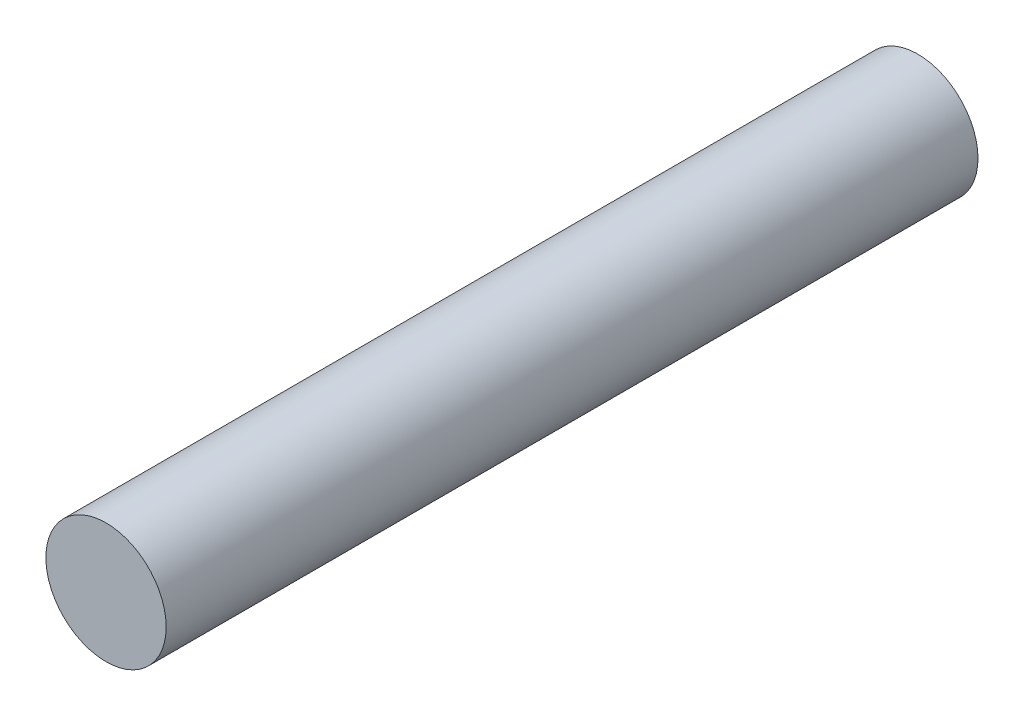
ISO-10303-21;
HEADER;
FILE_DESCRIPTION(('STEP AP214'),'2;1');
FILE_NAME('part.step','',(''),(''),'','','');
FILE_SCHEMA(('AUTOMOTIVE_DESIGN { 1 0 10303 214 1 1 1 1 }'));
ENDSEC;
DATA;
#1=APPLICATION_CONTEXT('core data for automotive mechanical design processes');
#2=APPLICATION_PROTOCOL_DEFINITION('international standard','automotive_design',2000,#1);
#3=PRODUCT_CONTEXT('',#1,'mechanical');
#4=PRODUCT('Part','Part','',(#3));
#5=PRODUCT_RELATED_PRODUCT_CATEGORY('part','',(#4));
#6=PRODUCT_DEFINITION_FORMATION('','',#4);
#7=PRODUCT_DEFINITION_CONTEXT('part definition',#1,'design');
#8=PRODUCT_DEFINITION('design','',#6,#7);
#9=PRODUCT_DEFINITION_SHAPE('','',#8);
#10=(LENGTH_UNIT() NAMED_UNIT(*) SI_UNIT(.MILLI.,.METRE.));
#11=(NAMED_UNIT(*) PLANE_ANGLE_UNIT() SI_UNIT($,.RADIAN.));
#12=(NAMED_UNIT(*) SI_UNIT($,.STERADIAN.) SOLID_ANGLE_UNIT());
#13=UNCERTAINTY_MEASURE_WITH_UNIT(LENGTH_MEASURE(1.E-05),#10,'distance_accuracy_value','');
#14=(GEOMETRIC_REPRESENTATION_CONTEXT(3) GLOBAL_UNCERTAINTY_ASSIGNED_CONTEXT((#13)) GLOBAL_UNIT_ASSIGNED_CONTEXT((#10,
#11,#12)) REPRESENTATION_CONTEXT('',''));
#15=CARTESIAN_POINT('',(0.,0.,0.));
#16=DIRECTION('',(0.,0.,1.));
#17=DIRECTION('',(1.,0.,0.));
#18=AXIS2_PLACEMENT_3D('',#15,#16,#17);
#19=CARTESIAN_POINT('',(0.,0.,42.8625));
#20=DIRECTION('',(0.,0.,-1.));
#21=DIRECTION('',(-1.,0.,0.));
#22=AXIS2_PLACEMENT_3D('',#19,#20,#21);
#23=CYLINDRICAL_SURFACE('',#22,3.175);
#24=CARTESIAN_POINT('',(0.,0.,42.8625));
#25=DIRECTION('',(0.,0.,1.));
#26=DIRECTION('',(1.,0.,0.));
#27=AXIS2_PLACEMENT_3D('',#24,#25,#26);
#28=CIRCLE('',#27,3.175);
#29=CARTESIAN_POINT('',(3.175,0.,42.8625));
#30=VERTEX_POINT('',#29);
#31=EDGE_CURVE('E10',#30,#30,#28,.T.);
#32=ORIENTED_EDGE('',*,*,#31,.F.);
#33=EDGE_LOOP('',(#32));
#34=FACE_BOUND('',#33,.T.);
#35=CARTESIAN_POINT('',(0.,0.,0.));
#36=DIRECTION('',(0.,0.,1.));
#37=DIRECTION('',(1.,0.,0.));
#38=AXIS2_PLACEMENT_3D('',#35,#36,#37);
#39=CIRCLE('',#38,3.175);
#40=CARTESIAN_POINT('',(3.175,0.,0.));
#41=VERTEX_POINT('',#40);
#42=EDGE_CURVE('E32',#41,#41,#39,.T.);
#43=ORIENTED_EDGE('',*,*,#42,.T.);
#44=EDGE_LOOP('',(#43));
#45=FACE_BOUND('',#44,.T.);
#46=ADVANCED_FACE('F29',(#34,#45),#23,.T.);
#47=CARTESIAN_POINT('',(0.,0.,42.8625));
#48=DIRECTION('',(0.,0.,1.));
#49=DIRECTION('',(1.,0.,0.));
#50=AXIS2_PLACEMENT_3D('',#47,#48,#49);
#51=PLANE('',#50);
#52=ORIENTED_EDGE('',*,*,#31,.T.);
#53=EDGE_LOOP('',(#52));
#54=FACE_BOUND('',#53,.T.);
#55=ADVANCED_FACE('F44',(#54),#51,.T.);
#56=CARTESIAN_POINT('',(0.,0.,0.));
#57=DIRECTION('',(0.,0.,1.));
#58=DIRECTION('',(1.,0.,0.));
#59=AXIS2_PLACEMENT_3D('',#56,#57,#58);
#60=PLANE('',#59);
#61=ORIENTED_EDGE('',*,*,#42,.F.);
#62=EDGE_LOOP('',(#61));
#63=FACE_BOUND('',#62,.T.);
#64=ADVANCED_FACE('F42',(#63),#60,.F.);
#65=CLOSED_SHELL('',(#46,#55,#64));
#66=MANIFOLD_SOLID_BREP('B2',#65);
#67=ADVANCED_BREP_SHAPE_REPRESENTATION('',(#18,#66),#14);
#68=SHAPE_DEFINITION_REPRESENTATION(#9,#67);
ENDSEC;
END-ISO-10303-21;
